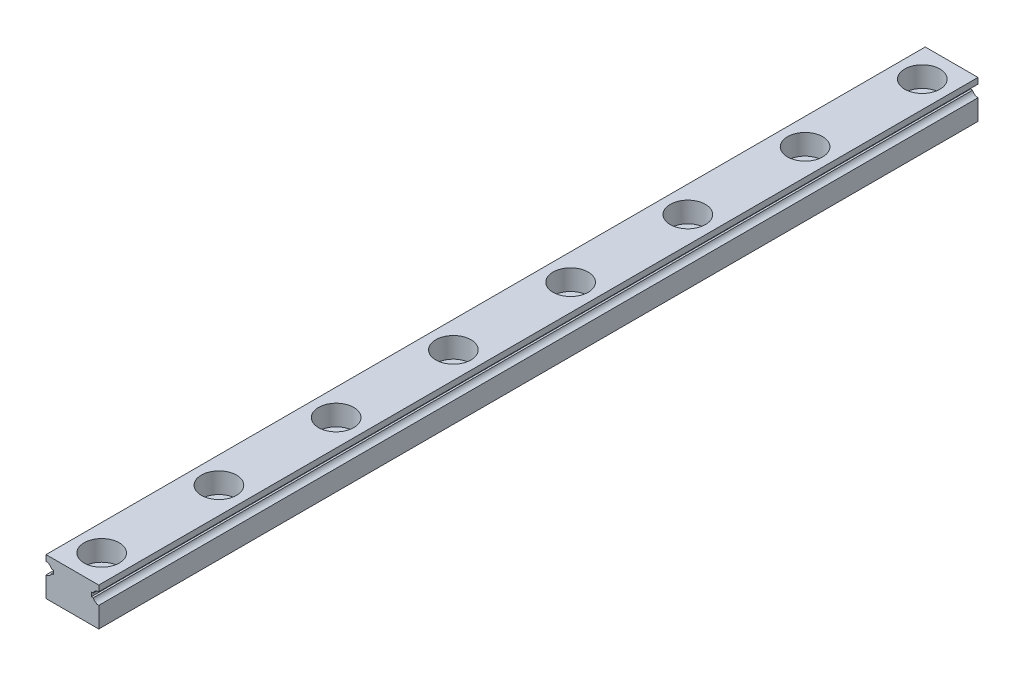
ISO-10303-21;
HEADER;
FILE_DESCRIPTION(('STEP AP214'),'2;1');
FILE_NAME('part.step','',(''),(''),'','','');
FILE_SCHEMA(('AUTOMOTIVE_DESIGN { 1 0 10303 214 1 1 1 1 }'));
ENDSEC;
DATA;
#1=APPLICATION_CONTEXT('core data for automotive mechanical design processes');
#2=APPLICATION_PROTOCOL_DEFINITION('international standard','automotive_design',2000,#1);
#3=PRODUCT_CONTEXT('',#1,'mechanical');
#4=PRODUCT('Part','Part','',(#3));
#5=PRODUCT_RELATED_PRODUCT_CATEGORY('part','',(#4));
#6=PRODUCT_DEFINITION_FORMATION('','',#4);
#7=PRODUCT_DEFINITION_CONTEXT('part definition',#1,'design');
#8=PRODUCT_DEFINITION('design','',#6,#7);
#9=PRODUCT_DEFINITION_SHAPE('','',#8);
#10=(LENGTH_UNIT() NAMED_UNIT(*) SI_UNIT(.MILLI.,.METRE.));
#11=(NAMED_UNIT(*) PLANE_ANGLE_UNIT() SI_UNIT($,.RADIAN.));
#12=(NAMED_UNIT(*) SI_UNIT($,.STERADIAN.) SOLID_ANGLE_UNIT());
#13=UNCERTAINTY_MEASURE_WITH_UNIT(LENGTH_MEASURE(1.E-05),#10,'distance_accuracy_value','');
#14=(GEOMETRIC_REPRESENTATION_CONTEXT(3) GLOBAL_UNCERTAINTY_ASSIGNED_CONTEXT((#13)) GLOBAL_UNIT_ASSIGNED_CONTEXT((#10,
#11,#12)) REPRESENTATION_CONTEXT('',''));
#15=CARTESIAN_POINT('',(0.,0.,0.));
#16=DIRECTION('',(0.,0.,1.));
#17=DIRECTION('',(1.,0.,0.));
#18=AXIS2_PLACEMENT_3D('',#15,#16,#17);
#19=CARTESIAN_POINT('',(4.5,2.25,150.));
#20=DIRECTION('',(-1.,0.,0.));
#21=DIRECTION('',(0.,-1.,0.));
#22=AXIS2_PLACEMENT_3D('',#19,#20,#21);
#23=PLANE('',#22);
#24=DIRECTION('',(0.,1.,0.));
#25=VECTOR('',#24,1.);
#26=CARTESIAN_POINT('',(4.5,2.25,0.));
#27=LINE('',#26,#25);
#28=CARTESIAN_POINT('',(4.5,2.25,0.));
#29=VERTEX_POINT('',#28);
#30=CARTESIAN_POINT('',(4.5,3.25,0.));
#31=VERTEX_POINT('',#30);
#32=EDGE_CURVE('E183',#29,#31,#27,.T.);
#33=ORIENTED_EDGE('',*,*,#32,.T.);
#34=DIRECTION('',(0.,0.,-1.));
#35=VECTOR('',#34,1.);
#36=CARTESIAN_POINT('',(4.5,3.25,150.));
#37=LINE('',#36,#35);
#38=CARTESIAN_POINT('',(4.5,3.25,150.));
#39=VERTEX_POINT('',#38);
#40=EDGE_CURVE('E251',#39,#31,#37,.T.);
#41=ORIENTED_EDGE('',*,*,#40,.F.);
#42=DIRECTION('',(0.,1.,0.));
#43=VECTOR('',#42,1.);
#44=CARTESIAN_POINT('',(4.5,2.25,150.));
#45=LINE('',#44,#43);
#46=CARTESIAN_POINT('',(4.5,2.25,150.));
#47=VERTEX_POINT('',#46);
#48=EDGE_CURVE('E214',#47,#39,#45,.T.);
#49=ORIENTED_EDGE('',*,*,#48,.F.);
#50=DIRECTION('',(0.,0.,-1.));
#51=VECTOR('',#50,1.);
#52=CARTESIAN_POINT('',(4.5,2.25,150.));
#53=LINE('',#52,#51);
#54=EDGE_CURVE('E179',#47,#29,#53,.T.);
#55=ORIENTED_EDGE('',*,*,#54,.T.);
#56=EDGE_LOOP('',(#33,#41,#49,#55));
#57=FACE_BOUND('',#56,.T.);
#58=ADVANCED_FACE('F35',(#57),#23,.F.);
#59=CARTESIAN_POINT('',(-4.5,3.25,150.));
#60=DIRECTION('',(0.,-1.,0.));
#61=DIRECTION('',(0.,0.,-1.));
#62=AXIS2_PLACEMENT_3D('',#59,#60,#61);
#63=PLANE('',#62);
#64=CARTESIAN_POINT('',(0.,3.25,25.));
#65=DIRECTION('',(0.,1.,0.));
#66=DIRECTION('',(0.,0.,1.));
#67=AXIS2_PLACEMENT_3D('',#64,#65,#66);
#68=CIRCLE('',#67,3.);
#69=CARTESIAN_POINT('',(0.,3.25,28.));
#70=VERTEX_POINT('',#69);
#71=EDGE_CURVE('E293',#70,#70,#68,.T.);
#72=ORIENTED_EDGE('',*,*,#71,.F.);
#73=EDGE_LOOP('',(#72));
#74=FACE_BOUND('',#73,.T.);
#75=CARTESIAN_POINT('',(0.,3.25,5.));
#76=DIRECTION('',(0.,1.,0.));
#77=DIRECTION('',(0.,0.,1.));
#78=AXIS2_PLACEMENT_3D('',#75,#76,#77);
#79=CIRCLE('',#78,3.);
#80=CARTESIAN_POINT('',(0.,3.25,8.));
#81=VERTEX_POINT('',#80);
#82=EDGE_CURVE('E257',#81,#81,#79,.T.);
#83=ORIENTED_EDGE('',*,*,#82,.F.);
#84=EDGE_LOOP('',(#83));
#85=FACE_BOUND('',#84,.T.);
#86=DIRECTION('',(-1.,0.,0.));
#87=VECTOR('',#86,1.);
#88=CARTESIAN_POINT('',(-4.5,3.25,0.));
#89=LINE('',#88,#87);
#90=CARTESIAN_POINT('',(-4.5,3.25,0.));
#91=VERTEX_POINT('',#90);
#92=EDGE_CURVE('E186',#31,#91,#89,.T.);
#93=ORIENTED_EDGE('',*,*,#92,.T.);
#94=DIRECTION('',(0.,0.,-1.));
#95=VECTOR('',#94,1.);
#96=CARTESIAN_POINT('',(-4.5,3.25,150.));
#97=LINE('',#96,#95);
#98=CARTESIAN_POINT('',(-4.5,3.25,150.));
#99=VERTEX_POINT('',#98);
#100=EDGE_CURVE('E248',#99,#91,#97,.T.);
#101=ORIENTED_EDGE('',*,*,#100,.F.);
#102=DIRECTION('',(-1.,0.,0.));
#103=VECTOR('',#102,1.);
#104=CARTESIAN_POINT('',(-4.5,3.25,150.));
#105=LINE('',#104,#103);
#106=EDGE_CURVE('E122',#39,#99,#105,.T.);
#107=ORIENTED_EDGE('',*,*,#106,.F.);
#108=ORIENTED_EDGE('',*,*,#40,.T.);
#109=EDGE_LOOP('',(#93,#101,#107,#108));
#110=FACE_BOUND('',#109,.T.);
#111=CARTESIAN_POINT('',(0.,3.25,45.));
#112=DIRECTION('',(0.,1.,0.));
#113=DIRECTION('',(0.,0.,1.));
#114=AXIS2_PLACEMENT_3D('',#111,#112,#113);
#115=CIRCLE('',#114,3.);
#116=CARTESIAN_POINT('',(0.,3.25,48.));
#117=VERTEX_POINT('',#116);
#118=EDGE_CURVE('E253',#117,#117,#115,.T.);
#119=ORIENTED_EDGE('',*,*,#118,.F.);
#120=EDGE_LOOP('',(#119));
#121=FACE_BOUND('',#120,.T.);
#122=CARTESIAN_POINT('',(0.,3.25,65.));
#123=DIRECTION('',(0.,1.,0.));
#124=DIRECTION('',(0.,0.,1.));
#125=AXIS2_PLACEMENT_3D('',#122,#123,#124);
#126=CIRCLE('',#125,3.);
#127=CARTESIAN_POINT('',(0.,3.25,68.));
#128=VERTEX_POINT('',#127);
#129=EDGE_CURVE('E264',#128,#128,#126,.T.);
#130=ORIENTED_EDGE('',*,*,#129,.F.);
#131=EDGE_LOOP('',(#130));
#132=FACE_BOUND('',#131,.T.);
#133=CARTESIAN_POINT('',(0.,3.25,85.));
#134=DIRECTION('',(0.,1.,0.));
#135=DIRECTION('',(0.,0.,1.));
#136=AXIS2_PLACEMENT_3D('',#133,#134,#135);
#137=CIRCLE('',#136,3.);
#138=CARTESIAN_POINT('',(0.,3.25,88.));
#139=VERTEX_POINT('',#138);
#140=EDGE_CURVE('E270',#139,#139,#137,.T.);
#141=ORIENTED_EDGE('',*,*,#140,.F.);
#142=EDGE_LOOP('',(#141));
#143=FACE_BOUND('',#142,.T.);
#144=CARTESIAN_POINT('',(0.,3.25,105.));
#145=DIRECTION('',(0.,1.,0.));
#146=DIRECTION('',(0.,0.,1.));
#147=AXIS2_PLACEMENT_3D('',#144,#145,#146);
#148=CIRCLE('',#147,3.);
#149=CARTESIAN_POINT('',(0.,3.25,108.));
#150=VERTEX_POINT('',#149);
#151=EDGE_CURVE('E276',#150,#150,#148,.T.);
#152=ORIENTED_EDGE('',*,*,#151,.F.);
#153=EDGE_LOOP('',(#152));
#154=FACE_BOUND('',#153,.T.);
#155=CARTESIAN_POINT('',(0.,3.25,125.));
#156=DIRECTION('',(0.,1.,0.));
#157=DIRECTION('',(0.,0.,1.));
#158=AXIS2_PLACEMENT_3D('',#155,#156,#157);
#159=CIRCLE('',#158,3.);
#160=CARTESIAN_POINT('',(0.,3.25,128.));
#161=VERTEX_POINT('',#160);
#162=EDGE_CURVE('E282',#161,#161,#159,.T.);
#163=ORIENTED_EDGE('',*,*,#162,.F.);
#164=EDGE_LOOP('',(#163));
#165=FACE_BOUND('',#164,.T.);
#166=CARTESIAN_POINT('',(0.,3.25,145.));
#167=DIRECTION('',(0.,1.,0.));
#168=DIRECTION('',(0.,0.,1.));
#169=AXIS2_PLACEMENT_3D('',#166,#167,#168);
#170=CIRCLE('',#169,3.);
#171=CARTESIAN_POINT('',(0.,3.25,148.));
#172=VERTEX_POINT('',#171);
#173=EDGE_CURVE('E45',#172,#172,#170,.T.);
#174=ORIENTED_EDGE('',*,*,#173,.F.);
#175=EDGE_LOOP('',(#174));
#176=FACE_BOUND('',#175,.T.);
#177=ADVANCED_FACE('F393',(#74,#85,#110,#121,#132,#143,#154,#165,#176),#63,.F.);
#178=CARTESIAN_POINT('',(-4.5,2.25,150.));
#179=DIRECTION('',(1.,0.,0.));
#180=DIRECTION('',(0.,0.,-1.));
#181=AXIS2_PLACEMENT_3D('',#178,#179,#180);
#182=PLANE('',#181);
#183=DIRECTION('',(0.,-1.,0.));
#184=VECTOR('',#183,1.);
#185=CARTESIAN_POINT('',(-4.5,2.25,0.));
#186=LINE('',#185,#184);
#187=CARTESIAN_POINT('',(-4.5,2.25,0.));
#188=VERTEX_POINT('',#187);
#189=EDGE_CURVE('E189',#91,#188,#186,.T.);
#190=ORIENTED_EDGE('',*,*,#189,.T.);
#191=DIRECTION('',(0.,0.,-1.));
#192=VECTOR('',#191,1.);
#193=CARTESIAN_POINT('',(-4.5,2.25,150.));
#194=LINE('',#193,#192);
#195=CARTESIAN_POINT('',(-4.5,2.25,150.));
#196=VERTEX_POINT('',#195);
#197=EDGE_CURVE('E245',#196,#188,#194,.T.);
#198=ORIENTED_EDGE('',*,*,#197,.F.);
#199=DIRECTION('',(0.,-1.,0.));
#200=VECTOR('',#199,1.);
#201=CARTESIAN_POINT('',(-4.5,2.25,150.));
#202=LINE('',#201,#200);
#203=EDGE_CURVE('E346',#99,#196,#202,.T.);
#204=ORIENTED_EDGE('',*,*,#203,.F.);
#205=ORIENTED_EDGE('',*,*,#100,.T.);
#206=EDGE_LOOP('',(#190,#198,#204,#205));
#207=FACE_BOUND('',#206,.T.);
#208=ADVANCED_FACE('F398',(#207),#182,.F.);
#209=CARTESIAN_POINT('',(-4.5,1.25,150.));
#210=DIRECTION('',(0.,0.,-1.));
#211=DIRECTION('',(-1.,0.,0.));
#212=AXIS2_PLACEMENT_3D('',#209,#210,#211);
#213=CYLINDRICAL_SURFACE('',#212,1.);
#214=CARTESIAN_POINT('',(-4.5,1.25,0.));
#215=DIRECTION('',(0.,0.,-1.));
#216=DIRECTION('',(1.,0.,0.));
#217=AXIS2_PLACEMENT_3D('',#214,#215,#216);
#218=CIRCLE('',#217,1.);
#219=CARTESIAN_POINT('',(-3.56399113733362,1.60197643246385,0.));
#220=VERTEX_POINT('',#219);
#221=EDGE_CURVE('E191',#188,#220,#218,.T.);
#222=ORIENTED_EDGE('',*,*,#221,.T.);
#223=DIRECTION('',(0.,0.,-1.));
#224=VECTOR('',#223,1.);
#225=CARTESIAN_POINT('',(-3.56399113733362,1.60197643246385,150.));
#226=LINE('',#225,#224);
#227=CARTESIAN_POINT('',(-3.56399113733362,1.60197643246385,150.));
#228=VERTEX_POINT('',#227);
#229=EDGE_CURVE('E242',#228,#220,#226,.T.);
#230=ORIENTED_EDGE('',*,*,#229,.F.);
#231=CARTESIAN_POINT('',(-4.5,1.25,150.));
#232=DIRECTION('',(0.,0.,-1.));
#233=DIRECTION('',(1.,0.,0.));
#234=AXIS2_PLACEMENT_3D('',#231,#232,#233);
#235=CIRCLE('',#234,1.);
#236=EDGE_CURVE('E348',#196,#228,#235,.T.);
#237=ORIENTED_EDGE('',*,*,#236,.F.);
#238=ORIENTED_EDGE('',*,*,#197,.T.);
#239=EDGE_LOOP('',(#222,#230,#237,#238));
#240=FACE_BOUND('',#239,.T.);
#241=ADVANCED_FACE('F523',(#240),#213,.F.);
#242=CARTESIAN_POINT('',(-3.56399113733362,1.60197643246385,150.));
#243=DIRECTION('',(0.,1.,0.));
#244=DIRECTION('',(0.,0.,1.));
#245=AXIS2_PLACEMENT_3D('',#242,#243,#244);
#246=PLANE('',#245);
#247=DIRECTION('',(1.,0.,0.));
#248=VECTOR('',#247,1.);
#249=CARTESIAN_POINT('',(-3.56399113733362,1.60197643246385,0.));
#250=LINE('',#249,#248);
#251=CARTESIAN_POINT('',(-3.23507302495561,1.60197643246385,0.));
#252=VERTEX_POINT('',#251);
#253=EDGE_CURVE('E193',#220,#252,#250,.T.);
#254=ORIENTED_EDGE('',*,*,#253,.T.);
#255=DIRECTION('',(0.,0.,-1.));
#256=VECTOR('',#255,1.);
#257=CARTESIAN_POINT('',(-3.23507302495561,1.60197643246385,150.));
#258=LINE('',#257,#256);
#259=CARTESIAN_POINT('',(-3.23507302495561,1.60197643246385,150.));
#260=VERTEX_POINT('',#259);
#261=EDGE_CURVE('E239',#260,#252,#258,.T.);
#262=ORIENTED_EDGE('',*,*,#261,.F.);
#263=DIRECTION('',(1.,0.,0.));
#264=VECTOR('',#263,1.);
#265=CARTESIAN_POINT('',(-3.56399113733362,1.60197643246385,150.));
#266=LINE('',#265,#264);
#267=EDGE_CURVE('E350',#228,#260,#266,.T.);
#268=ORIENTED_EDGE('',*,*,#267,.F.);
#269=ORIENTED_EDGE('',*,*,#229,.T.);
#270=EDGE_LOOP('',(#254,#262,#268,#269));
#271=FACE_BOUND('',#270,.T.);
#272=ADVANCED_FACE('F519',(#271),#246,.F.);
#273=CARTESIAN_POINT('',(-3.23507302495561,0.898023567536146,150.));
#274=DIRECTION('',(1.,0.,0.));
#275=DIRECTION('',(0.,0.,-1.));
#276=AXIS2_PLACEMENT_3D('',#273,#274,#275);
#277=PLANE('',#276);
#278=DIRECTION('',(0.,-1.,0.));
#279=VECTOR('',#278,1.);
#280=CARTESIAN_POINT('',(-3.23507302495561,0.898023567536146,0.));
#281=LINE('',#280,#279);
#282=CARTESIAN_POINT('',(-3.23507302495561,0.898023567536146,0.));
#283=VERTEX_POINT('',#282);
#284=EDGE_CURVE('E195',#252,#283,#281,.T.);
#285=ORIENTED_EDGE('',*,*,#284,.T.);
#286=DIRECTION('',(0.,0.,-1.));
#287=VECTOR('',#286,1.);
#288=CARTESIAN_POINT('',(-3.23507302495561,0.898023567536146,150.));
#289=LINE('',#288,#287);
#290=CARTESIAN_POINT('',(-3.23507302495561,0.898023567536146,150.));
#291=VERTEX_POINT('',#290);
#292=EDGE_CURVE('E236',#291,#283,#289,.T.);
#293=ORIENTED_EDGE('',*,*,#292,.F.);
#294=DIRECTION('',(0.,-1.,0.));
#295=VECTOR('',#294,1.);
#296=CARTESIAN_POINT('',(-3.23507302495561,0.898023567536146,150.));
#297=LINE('',#296,#295);
#298=EDGE_CURVE('E352',#260,#291,#297,.T.);
#299=ORIENTED_EDGE('',*,*,#298,.F.);
#300=ORIENTED_EDGE('',*,*,#261,.T.);
#301=EDGE_LOOP('',(#285,#293,#299,#300));
#302=FACE_BOUND('',#301,.T.);
#303=ADVANCED_FACE('F515',(#302),#277,.F.);
#304=CARTESIAN_POINT('',(-3.56399113733362,0.898023567536146,150.));
#305=DIRECTION('',(0.,-1.,0.));
#306=DIRECTION('',(0.,0.,-1.));
#307=AXIS2_PLACEMENT_3D('',#304,#305,#306);
#308=PLANE('',#307);
#309=DIRECTION('',(-1.,0.,0.));
#310=VECTOR('',#309,1.);
#311=CARTESIAN_POINT('',(-3.56399113733362,0.898023567536146,0.));
#312=LINE('',#311,#310);
#313=CARTESIAN_POINT('',(-3.56399113733362,0.898023567536146,0.));
#314=VERTEX_POINT('',#313);
#315=EDGE_CURVE('E197',#283,#314,#312,.T.);
#316=ORIENTED_EDGE('',*,*,#315,.T.);
#317=DIRECTION('',(0.,0.,-1.));
#318=VECTOR('',#317,1.);
#319=CARTESIAN_POINT('',(-3.56399113733362,0.898023567536146,150.));
#320=LINE('',#319,#318);
#321=CARTESIAN_POINT('',(-3.56399113733362,0.898023567536146,150.));
#322=VERTEX_POINT('',#321);
#323=EDGE_CURVE('E233',#322,#314,#320,.T.);
#324=ORIENTED_EDGE('',*,*,#323,.F.);
#325=DIRECTION('',(-1.,0.,0.));
#326=VECTOR('',#325,1.);
#327=CARTESIAN_POINT('',(-3.56399113733362,0.898023567536146,150.));
#328=LINE('',#327,#326);
#329=EDGE_CURVE('E354',#291,#322,#328,.T.);
#330=ORIENTED_EDGE('',*,*,#329,.F.);
#331=ORIENTED_EDGE('',*,*,#292,.T.);
#332=EDGE_LOOP('',(#316,#324,#330,#331));
#333=FACE_BOUND('',#332,.T.);
#334=ADVANCED_FACE('F511',(#333),#308,.F.);
#335=CARTESIAN_POINT('',(-4.5,1.25,150.));
#336=DIRECTION('',(0.,0.,-1.));
#337=DIRECTION('',(-1.,0.,0.));
#338=AXIS2_PLACEMENT_3D('',#335,#336,#337);
#339=CYLINDRICAL_SURFACE('',#338,1.);
#340=CARTESIAN_POINT('',(-4.5,1.25,0.));
#341=DIRECTION('',(0.,0.,-1.));
#342=DIRECTION('',(1.,0.,0.));
#343=AXIS2_PLACEMENT_3D('',#340,#341,#342);
#344=CIRCLE('',#343,1.);
#345=CARTESIAN_POINT('',(-4.5,0.25,0.));
#346=VERTEX_POINT('',#345);
#347=EDGE_CURVE('E199',#314,#346,#344,.T.);
#348=ORIENTED_EDGE('',*,*,#347,.T.);
#349=DIRECTION('',(0.,0.,-1.));
#350=VECTOR('',#349,1.);
#351=CARTESIAN_POINT('',(-4.5,0.25,150.));
#352=LINE('',#351,#350);
#353=CARTESIAN_POINT('',(-4.5,0.25,150.));
#354=VERTEX_POINT('',#353);
#355=EDGE_CURVE('E230',#354,#346,#352,.T.);
#356=ORIENTED_EDGE('',*,*,#355,.F.);
#357=CARTESIAN_POINT('',(-4.5,1.25,150.));
#358=DIRECTION('',(0.,0.,-1.));
#359=DIRECTION('',(1.,0.,0.));
#360=AXIS2_PLACEMENT_3D('',#357,#358,#359);
#361=CIRCLE('',#360,1.);
#362=EDGE_CURVE('E356',#322,#354,#361,.T.);
#363=ORIENTED_EDGE('',*,*,#362,.F.);
#364=ORIENTED_EDGE('',*,*,#323,.T.);
#365=EDGE_LOOP('',(#348,#356,#363,#364));
#366=FACE_BOUND('',#365,.T.);
#367=ADVANCED_FACE('F507',(#366),#339,.F.);
#368=CARTESIAN_POINT('',(-4.5,-3.25,150.));
#369=DIRECTION('',(1.,0.,0.));
#370=DIRECTION('',(0.,0.,-1.));
#371=AXIS2_PLACEMENT_3D('',#368,#369,#370);
#372=PLANE('',#371);
#373=DIRECTION('',(0.,-1.,0.));
#374=VECTOR('',#373,1.);
#375=CARTESIAN_POINT('',(-4.5,-3.25,0.));
#376=LINE('',#375,#374);
#377=CARTESIAN_POINT('',(-4.5,-3.25,0.));
#378=VERTEX_POINT('',#377);
#379=EDGE_CURVE('E201',#346,#378,#376,.T.);
#380=ORIENTED_EDGE('',*,*,#379,.T.);
#381=DIRECTION('',(0.,0.,-1.));
#382=VECTOR('',#381,1.);
#383=CARTESIAN_POINT('',(-4.5,-3.25,150.));
#384=LINE('',#383,#382);
#385=CARTESIAN_POINT('',(-4.5,-3.25,150.));
#386=VERTEX_POINT('',#385);
#387=EDGE_CURVE('E227',#386,#378,#384,.T.);
#388=ORIENTED_EDGE('',*,*,#387,.F.);
#389=DIRECTION('',(0.,-1.,0.));
#390=VECTOR('',#389,1.);
#391=CARTESIAN_POINT('',(-4.5,-3.25,150.));
#392=LINE('',#391,#390);
#393=EDGE_CURVE('E358',#354,#386,#392,.T.);
#394=ORIENTED_EDGE('',*,*,#393,.F.);
#395=ORIENTED_EDGE('',*,*,#355,.T.);
#396=EDGE_LOOP('',(#380,#388,#394,#395));
#397=FACE_BOUND('',#396,.T.);
#398=ADVANCED_FACE('F475',(#397),#372,.F.);
#399=CARTESIAN_POINT('',(-4.5,-3.25,150.));
#400=DIRECTION('',(0.,1.,0.));
#401=DIRECTION('',(0.,0.,1.));
#402=AXIS2_PLACEMENT_3D('',#399,#400,#401);
#403=PLANE('',#402);
#404=CARTESIAN_POINT('',(0.,-3.25,145.));
#405=DIRECTION('',(0.,1.,0.));
#406=DIRECTION('',(0.,0.,1.));
#407=AXIS2_PLACEMENT_3D('',#404,#405,#406);
#408=CIRCLE('',#407,1.75);
#409=CARTESIAN_POINT('',(0.,-3.25,146.75));
#410=VERTEX_POINT('',#409);
#411=EDGE_CURVE('E322',#410,#410,#408,.T.);
#412=ORIENTED_EDGE('',*,*,#411,.T.);
#413=EDGE_LOOP('',(#412));
#414=FACE_BOUND('',#413,.T.);
#415=CARTESIAN_POINT('',(0.,-3.25,125.));
#416=DIRECTION('',(0.,1.,0.));
#417=DIRECTION('',(0.,0.,1.));
#418=AXIS2_PLACEMENT_3D('',#415,#416,#417);
#419=CIRCLE('',#418,1.75);
#420=CARTESIAN_POINT('',(0.,-3.25,126.75));
#421=VERTEX_POINT('',#420);
#422=EDGE_CURVE('E312',#421,#421,#419,.T.);
#423=ORIENTED_EDGE('',*,*,#422,.T.);
#424=EDGE_LOOP('',(#423));
#425=FACE_BOUND('',#424,.T.);
#426=CARTESIAN_POINT('',(0.,-3.25,105.));
#427=DIRECTION('',(0.,1.,0.));
#428=DIRECTION('',(0.,0.,1.));
#429=AXIS2_PLACEMENT_3D('',#426,#427,#428);
#430=CIRCLE('',#429,1.75);
#431=CARTESIAN_POINT('',(0.,-3.25,106.75));
#432=VERTEX_POINT('',#431);
#433=EDGE_CURVE('E309',#432,#432,#430,.T.);
#434=ORIENTED_EDGE('',*,*,#433,.T.);
#435=EDGE_LOOP('',(#434));
#436=FACE_BOUND('',#435,.T.);
#437=CARTESIAN_POINT('',(0.,-3.25,85.));
#438=DIRECTION('',(0.,1.,0.));
#439=DIRECTION('',(0.,0.,1.));
#440=AXIS2_PLACEMENT_3D('',#437,#438,#439);
#441=CIRCLE('',#440,1.75);
#442=CARTESIAN_POINT('',(0.,-3.25,86.75));
#443=VERTEX_POINT('',#442);
#444=EDGE_CURVE('E306',#443,#443,#441,.T.);
#445=ORIENTED_EDGE('',*,*,#444,.T.);
#446=EDGE_LOOP('',(#445));
#447=FACE_BOUND('',#446,.T.);
#448=CARTESIAN_POINT('',(0.,-3.25,65.));
#449=DIRECTION('',(0.,1.,0.));
#450=DIRECTION('',(0.,0.,1.));
#451=AXIS2_PLACEMENT_3D('',#448,#449,#450);
#452=CIRCLE('',#451,1.75);
#453=CARTESIAN_POINT('',(0.,-3.25,66.75));
#454=VERTEX_POINT('',#453);
#455=EDGE_CURVE('E302',#454,#454,#452,.T.);
#456=ORIENTED_EDGE('',*,*,#455,.T.);
#457=EDGE_LOOP('',(#456));
#458=FACE_BOUND('',#457,.T.);
#459=CARTESIAN_POINT('',(0.,-3.25,45.));
#460=DIRECTION('',(0.,1.,0.));
#461=DIRECTION('',(0.,0.,1.));
#462=AXIS2_PLACEMENT_3D('',#459,#460,#461);
#463=CIRCLE('',#462,1.75);
#464=CARTESIAN_POINT('',(0.,-3.25,46.75));
#465=VERTEX_POINT('',#464);
#466=EDGE_CURVE('E298',#465,#465,#463,.T.);
#467=ORIENTED_EDGE('',*,*,#466,.T.);
#468=EDGE_LOOP('',(#467));
#469=FACE_BOUND('',#468,.T.);
#470=CARTESIAN_POINT('',(0.,-3.25,25.));
#471=DIRECTION('',(0.,1.,0.));
#472=DIRECTION('',(0.,0.,1.));
#473=AXIS2_PLACEMENT_3D('',#470,#471,#472);
#474=CIRCLE('',#473,1.75);
#475=CARTESIAN_POINT('',(0.,-3.25,26.75));
#476=VERTEX_POINT('',#475);
#477=EDGE_CURVE('E294',#476,#476,#474,.T.);
#478=ORIENTED_EDGE('',*,*,#477,.T.);
#479=EDGE_LOOP('',(#478));
#480=FACE_BOUND('',#479,.T.);
#481=CARTESIAN_POINT('',(0.,-3.25,5.));
#482=DIRECTION('',(0.,1.,0.));
#483=DIRECTION('',(0.,0.,1.));
#484=AXIS2_PLACEMENT_3D('',#481,#482,#483);
#485=CIRCLE('',#484,1.75);
#486=CARTESIAN_POINT('',(0.,-3.25,6.75));
#487=VERTEX_POINT('',#486);
#488=EDGE_CURVE('E258',#487,#487,#485,.T.);
#489=ORIENTED_EDGE('',*,*,#488,.T.);
#490=EDGE_LOOP('',(#489));
#491=FACE_BOUND('',#490,.T.);
#492=DIRECTION('',(1.,0.,0.));
#493=VECTOR('',#492,1.);
#494=CARTESIAN_POINT('',(-4.5,-3.25,0.));
#495=LINE('',#494,#493);
#496=CARTESIAN_POINT('',(4.5,-3.25,0.));
#497=VERTEX_POINT('',#496);
#498=EDGE_CURVE('E203',#378,#497,#495,.T.);
#499=ORIENTED_EDGE('',*,*,#498,.T.);
#500=DIRECTION('',(0.,0.,-1.));
#501=VECTOR('',#500,1.);
#502=CARTESIAN_POINT('',(4.5,-3.25,150.));
#503=LINE('',#502,#501);
#504=CARTESIAN_POINT('',(4.5,-3.25,150.));
#505=VERTEX_POINT('',#504);
#506=EDGE_CURVE('E224',#505,#497,#503,.T.);
#507=ORIENTED_EDGE('',*,*,#506,.F.);
#508=DIRECTION('',(1.,0.,0.));
#509=VECTOR('',#508,1.);
#510=CARTESIAN_POINT('',(-4.5,-3.25,150.));
#511=LINE('',#510,#509);
#512=EDGE_CURVE('E360',#386,#505,#511,.T.);
#513=ORIENTED_EDGE('',*,*,#512,.F.);
#514=ORIENTED_EDGE('',*,*,#387,.T.);
#515=EDGE_LOOP('',(#499,#507,#513,#514));
#516=FACE_BOUND('',#515,.T.);
#517=ADVANCED_FACE('F472',(#414,#425,#436,#447,#458,#469,#480,#491,#516),#403,.F.);
#518=CARTESIAN_POINT('',(4.5,-3.25,150.));
#519=DIRECTION('',(-1.,0.,0.));
#520=DIRECTION('',(0.,-1.,0.));
#521=AXIS2_PLACEMENT_3D('',#518,#519,#520);
#522=PLANE('',#521);
#523=DIRECTION('',(0.,1.,0.));
#524=VECTOR('',#523,1.);
#525=CARTESIAN_POINT('',(4.5,-3.25,0.));
#526=LINE('',#525,#524);
#527=CARTESIAN_POINT('',(4.5,0.25,0.));
#528=VERTEX_POINT('',#527);
#529=EDGE_CURVE('E205',#497,#528,#526,.T.);
#530=ORIENTED_EDGE('',*,*,#529,.T.);
#531=DIRECTION('',(0.,0.,-1.));
#532=VECTOR('',#531,1.);
#533=CARTESIAN_POINT('',(4.5,0.25,150.));
#534=LINE('',#533,#532);
#535=CARTESIAN_POINT('',(4.5,0.25,150.));
#536=VERTEX_POINT('',#535);
#537=EDGE_CURVE('E221',#536,#528,#534,.T.);
#538=ORIENTED_EDGE('',*,*,#537,.F.);
#539=DIRECTION('',(0.,1.,0.));
#540=VECTOR('',#539,1.);
#541=CARTESIAN_POINT('',(4.5,-3.25,150.));
#542=LINE('',#541,#540);
#543=EDGE_CURVE('E362',#505,#536,#542,.T.);
#544=ORIENTED_EDGE('',*,*,#543,.F.);
#545=ORIENTED_EDGE('',*,*,#506,.T.);
#546=EDGE_LOOP('',(#530,#538,#544,#545));
#547=FACE_BOUND('',#546,.T.);
#548=ADVANCED_FACE('F474',(#547),#522,.F.);
#549=CARTESIAN_POINT('',(4.5,1.25,150.));
#550=DIRECTION('',(0.,0.,-1.));
#551=DIRECTION('',(-1.,0.,0.));
#552=AXIS2_PLACEMENT_3D('',#549,#550,#551);
#553=CYLINDRICAL_SURFACE('',#552,1.);
#554=CARTESIAN_POINT('',(4.5,1.25,0.));
#555=DIRECTION('',(0.,0.,-1.));
#556=DIRECTION('',(-1.,0.,0.));
#557=AXIS2_PLACEMENT_3D('',#554,#555,#556);
#558=CIRCLE('',#557,1.);
#559=CARTESIAN_POINT('',(3.56399113733362,0.898023567536145,0.));
#560=VERTEX_POINT('',#559);
#561=EDGE_CURVE('E207',#528,#560,#558,.T.);
#562=ORIENTED_EDGE('',*,*,#561,.T.);
#563=DIRECTION('',(0.,0.,-1.));
#564=VECTOR('',#563,1.);
#565=CARTESIAN_POINT('',(3.56399113733362,0.898023567536145,150.));
#566=LINE('',#565,#564);
#567=CARTESIAN_POINT('',(3.56399113733362,0.898023567536145,150.));
#568=VERTEX_POINT('',#567);
#569=EDGE_CURVE('E218',#568,#560,#566,.T.);
#570=ORIENTED_EDGE('',*,*,#569,.F.);
#571=CARTESIAN_POINT('',(4.5,1.25,150.));
#572=DIRECTION('',(0.,0.,-1.));
#573=DIRECTION('',(-1.,0.,0.));
#574=AXIS2_PLACEMENT_3D('',#571,#572,#573);
#575=CIRCLE('',#574,1.);
#576=EDGE_CURVE('E364',#536,#568,#575,.T.);
#577=ORIENTED_EDGE('',*,*,#576,.F.);
#578=ORIENTED_EDGE('',*,*,#537,.T.);
#579=EDGE_LOOP('',(#562,#570,#577,#578));
#580=FACE_BOUND('',#579,.T.);
#581=ADVANCED_FACE('F370',(#580),#553,.F.);
#582=CARTESIAN_POINT('',(3.56399113733362,0.898023567536146,150.));
#583=DIRECTION('',(0.,-1.,0.));
#584=DIRECTION('',(0.,0.,-1.));
#585=AXIS2_PLACEMENT_3D('',#582,#583,#584);
#586=PLANE('',#585);
#587=DIRECTION('',(-1.,0.,0.));
#588=VECTOR('',#587,1.);
#589=CARTESIAN_POINT('',(3.56399113733362,0.898023567536146,0.));
#590=LINE('',#589,#588);
#591=CARTESIAN_POINT('',(3.23507302495561,0.898023567536146,0.));
#592=VERTEX_POINT('',#591);
#593=EDGE_CURVE('E209',#560,#592,#590,.T.);
#594=ORIENTED_EDGE('',*,*,#593,.T.);
#595=DIRECTION('',(0.,0.,-1.));
#596=VECTOR('',#595,1.);
#597=CARTESIAN_POINT('',(3.23507302495561,0.898023567536146,150.));
#598=LINE('',#597,#596);
#599=CARTESIAN_POINT('',(3.23507302495561,0.898023567536146,150.));
#600=VERTEX_POINT('',#599);
#601=EDGE_CURVE('E174',#600,#592,#598,.T.);
#602=ORIENTED_EDGE('',*,*,#601,.F.);
#603=DIRECTION('',(-1.,0.,0.));
#604=VECTOR('',#603,1.);
#605=CARTESIAN_POINT('',(3.56399113733362,0.898023567536146,150.));
#606=LINE('',#605,#604);
#607=EDGE_CURVE('E165',#568,#600,#606,.T.);
#608=ORIENTED_EDGE('',*,*,#607,.F.);
#609=ORIENTED_EDGE('',*,*,#569,.T.);
#610=EDGE_LOOP('',(#594,#602,#608,#609));
#611=FACE_BOUND('',#610,.T.);
#612=ADVANCED_FACE('F374',(#611),#586,.F.);
#613=CARTESIAN_POINT('',(3.23507302495561,0.898023567536146,150.));
#614=DIRECTION('',(-1.,0.,0.));
#615=DIRECTION('',(0.,0.,1.));
#616=AXIS2_PLACEMENT_3D('',#613,#614,#615);
#617=PLANE('',#616);
#618=DIRECTION('',(0.,1.,0.));
#619=VECTOR('',#618,1.);
#620=CARTESIAN_POINT('',(3.23507302495561,0.898023567536146,0.));
#621=LINE('',#620,#619);
#622=CARTESIAN_POINT('',(3.23507302495561,1.60197643246385,0.));
#623=VERTEX_POINT('',#622);
#624=EDGE_CURVE('E173',#592,#623,#621,.T.);
#625=ORIENTED_EDGE('',*,*,#624,.T.);
#626=DIRECTION('',(0.,0.,-1.));
#627=VECTOR('',#626,1.);
#628=CARTESIAN_POINT('',(3.23507302495561,1.60197643246385,150.));
#629=LINE('',#628,#627);
#630=CARTESIAN_POINT('',(3.23507302495561,1.60197643246385,150.));
#631=VERTEX_POINT('',#630);
#632=EDGE_CURVE('E170',#631,#623,#629,.T.);
#633=ORIENTED_EDGE('',*,*,#632,.F.);
#634=DIRECTION('',(0.,1.,0.));
#635=VECTOR('',#634,1.);
#636=CARTESIAN_POINT('',(3.23507302495561,0.898023567536146,150.));
#637=LINE('',#636,#635);
#638=EDGE_CURVE('E159',#600,#631,#637,.T.);
#639=ORIENTED_EDGE('',*,*,#638,.F.);
#640=ORIENTED_EDGE('',*,*,#601,.T.);
#641=EDGE_LOOP('',(#625,#633,#639,#640));
#642=FACE_BOUND('',#641,.T.);
#643=ADVANCED_FACE('F171',(#642),#617,.F.);
#644=CARTESIAN_POINT('',(3.56399113733362,1.60197643246385,150.));
#645=DIRECTION('',(0.,1.,0.));
#646=DIRECTION('',(0.,0.,1.));
#647=AXIS2_PLACEMENT_3D('',#644,#645,#646);
#648=PLANE('',#647);
#649=DIRECTION('',(1.,0.,0.));
#650=VECTOR('',#649,1.);
#651=CARTESIAN_POINT('',(3.56399113733362,1.60197643246385,0.));
#652=LINE('',#651,#650);
#653=CARTESIAN_POINT('',(3.56399113733362,1.60197643246385,0.));
#654=VERTEX_POINT('',#653);
#655=EDGE_CURVE('E107',#623,#654,#652,.T.);
#656=ORIENTED_EDGE('',*,*,#655,.T.);
#657=DIRECTION('',(0.,0.,-1.));
#658=VECTOR('',#657,1.);
#659=CARTESIAN_POINT('',(3.56399113733362,1.60197643246385,150.));
#660=LINE('',#659,#658);
#661=CARTESIAN_POINT('',(3.56399113733362,1.60197643246385,150.));
#662=VERTEX_POINT('',#661);
#663=EDGE_CURVE('E175',#662,#654,#660,.T.);
#664=ORIENTED_EDGE('',*,*,#663,.F.);
#665=DIRECTION('',(1.,0.,0.));
#666=VECTOR('',#665,1.);
#667=CARTESIAN_POINT('',(3.56399113733362,1.60197643246385,150.));
#668=LINE('',#667,#666);
#669=EDGE_CURVE('E163',#631,#662,#668,.T.);
#670=ORIENTED_EDGE('',*,*,#669,.F.);
#671=ORIENTED_EDGE('',*,*,#632,.T.);
#672=EDGE_LOOP('',(#656,#664,#670,#671));
#673=FACE_BOUND('',#672,.T.);
#674=ADVANCED_FACE('F177',(#673),#648,.F.);
#675=CARTESIAN_POINT('',(4.5,1.25,150.));
#676=DIRECTION('',(0.,0.,-1.));
#677=DIRECTION('',(-1.,0.,0.));
#678=AXIS2_PLACEMENT_3D('',#675,#676,#677);
#679=CYLINDRICAL_SURFACE('',#678,1.);
#680=CARTESIAN_POINT('',(4.5,1.25,0.));
#681=DIRECTION('',(0.,0.,-1.));
#682=DIRECTION('',(-1.,0.,0.));
#683=AXIS2_PLACEMENT_3D('',#680,#681,#682);
#684=CIRCLE('',#683,1.);
#685=EDGE_CURVE('E113',#654,#29,#684,.T.);
#686=ORIENTED_EDGE('',*,*,#685,.T.);
#687=ORIENTED_EDGE('',*,*,#54,.F.);
#688=CARTESIAN_POINT('',(4.5,1.25,150.));
#689=DIRECTION('',(0.,0.,-1.));
#690=DIRECTION('',(-1.,0.,0.));
#691=AXIS2_PLACEMENT_3D('',#688,#689,#690);
#692=CIRCLE('',#691,1.);
#693=EDGE_CURVE('E54',#662,#47,#692,.T.);
#694=ORIENTED_EDGE('',*,*,#693,.F.);
#695=ORIENTED_EDGE('',*,*,#663,.T.);
#696=EDGE_LOOP('',(#686,#687,#694,#695));
#697=FACE_BOUND('',#696,.T.);
#698=ADVANCED_FACE('F382',(#697),#679,.F.);
#699=CARTESIAN_POINT('',(-4.5,1.25,150.));
#700=DIRECTION('',(0.,0.,1.));
#701=DIRECTION('',(1.,0.,0.));
#702=AXIS2_PLACEMENT_3D('',#699,#700,#701);
#703=PLANE('',#702);
#704=ORIENTED_EDGE('',*,*,#48,.T.);
#705=ORIENTED_EDGE('',*,*,#106,.T.);
#706=ORIENTED_EDGE('',*,*,#203,.T.);
#707=ORIENTED_EDGE('',*,*,#236,.T.);
#708=ORIENTED_EDGE('',*,*,#267,.T.);
#709=ORIENTED_EDGE('',*,*,#298,.T.);
#710=ORIENTED_EDGE('',*,*,#329,.T.);
#711=ORIENTED_EDGE('',*,*,#362,.T.);
#712=ORIENTED_EDGE('',*,*,#393,.T.);
#713=ORIENTED_EDGE('',*,*,#512,.T.);
#714=ORIENTED_EDGE('',*,*,#543,.T.);
#715=ORIENTED_EDGE('',*,*,#576,.T.);
#716=ORIENTED_EDGE('',*,*,#607,.T.);
#717=ORIENTED_EDGE('',*,*,#638,.T.);
#718=ORIENTED_EDGE('',*,*,#669,.T.);
#719=ORIENTED_EDGE('',*,*,#693,.T.);
#720=EDGE_LOOP('',(#704,#705,#706,#707,#708,#709,#710,#711,#712,#713,#714,#715,#716,#717,#718,#719));
#721=FACE_BOUND('',#720,.T.);
#722=ADVANCED_FACE('F161',(#721),#703,.T.);
#723=CARTESIAN_POINT('',(-4.5,1.25,0.));
#724=DIRECTION('',(0.,0.,1.));
#725=DIRECTION('',(1.,0.,0.));
#726=AXIS2_PLACEMENT_3D('',#723,#724,#725);
#727=PLANE('',#726);
#728=ORIENTED_EDGE('',*,*,#32,.F.);
#729=ORIENTED_EDGE('',*,*,#685,.F.);
#730=ORIENTED_EDGE('',*,*,#655,.F.);
#731=ORIENTED_EDGE('',*,*,#624,.F.);
#732=ORIENTED_EDGE('',*,*,#593,.F.);
#733=ORIENTED_EDGE('',*,*,#561,.F.);
#734=ORIENTED_EDGE('',*,*,#529,.F.);
#735=ORIENTED_EDGE('',*,*,#498,.F.);
#736=ORIENTED_EDGE('',*,*,#379,.F.);
#737=ORIENTED_EDGE('',*,*,#347,.F.);
#738=ORIENTED_EDGE('',*,*,#315,.F.);
#739=ORIENTED_EDGE('',*,*,#284,.F.);
#740=ORIENTED_EDGE('',*,*,#253,.F.);
#741=ORIENTED_EDGE('',*,*,#221,.F.);
#742=ORIENTED_EDGE('',*,*,#189,.F.);
#743=ORIENTED_EDGE('',*,*,#92,.F.);
#744=EDGE_LOOP('',(#728,#729,#730,#731,#732,#733,#734,#735,#736,#737,#738,#739,#740,#741,#742,#743));
#745=FACE_BOUND('',#744,.T.);
#746=ADVANCED_FACE('F377',(#745),#727,.F.);
#747=CARTESIAN_POINT('',(0.,-0.25,5.));
#748=DIRECTION('',(0.,1.,0.));
#749=DIRECTION('',(0.,0.,1.));
#750=AXIS2_PLACEMENT_3D('',#747,#748,#749);
#751=CYLINDRICAL_SURFACE('',#750,3.);
#752=CARTESIAN_POINT('',(0.,-0.25,5.));
#753=DIRECTION('',(0.,1.,0.));
#754=DIRECTION('',(0.,0.,1.));
#755=AXIS2_PLACEMENT_3D('',#752,#753,#754);
#756=CIRCLE('',#755,3.);
#757=CARTESIAN_POINT('',(0.,-0.25,8.));
#758=VERTEX_POINT('',#757);
#759=EDGE_CURVE('E187',#758,#758,#756,.T.);
#760=ORIENTED_EDGE('',*,*,#759,.F.);
#761=EDGE_LOOP('',(#760));
#762=FACE_BOUND('',#761,.T.);
#763=ORIENTED_EDGE('',*,*,#82,.T.);
#764=EDGE_LOOP('',(#763));
#765=FACE_BOUND('',#764,.T.);
#766=ADVANCED_FACE('F758',(#762,#765),#751,.F.);
#767=CARTESIAN_POINT('',(0.,-0.25,5.));
#768=DIRECTION('',(0.,1.,0.));
#769=DIRECTION('',(0.,0.,1.));
#770=AXIS2_PLACEMENT_3D('',#767,#768,#769);
#771=PLANE('',#770);
#772=CARTESIAN_POINT('',(0.,-0.25,5.));
#773=DIRECTION('',(0.,1.,0.));
#774=DIRECTION('',(0.,0.,1.));
#775=AXIS2_PLACEMENT_3D('',#772,#773,#774);
#776=CIRCLE('',#775,1.75);
#777=CARTESIAN_POINT('',(0.,-0.25,6.75));
#778=VERTEX_POINT('',#777);
#779=EDGE_CURVE('E254',#778,#778,#776,.T.);
#780=ORIENTED_EDGE('',*,*,#779,.F.);
#781=EDGE_LOOP('',(#780));
#782=FACE_BOUND('',#781,.T.);
#783=ORIENTED_EDGE('',*,*,#759,.T.);
#784=EDGE_LOOP('',(#783));
#785=FACE_BOUND('',#784,.T.);
#786=ADVANCED_FACE('F754',(#782,#785),#771,.T.);
#787=CARTESIAN_POINT('',(0.,-3.25,5.));
#788=DIRECTION('',(0.,1.,0.));
#789=DIRECTION('',(0.,0.,1.));
#790=AXIS2_PLACEMENT_3D('',#787,#788,#789);
#791=CYLINDRICAL_SURFACE('',#790,1.75);
#792=ORIENTED_EDGE('',*,*,#779,.T.);
#793=EDGE_LOOP('',(#792));
#794=FACE_BOUND('',#793,.T.);
#795=ORIENTED_EDGE('',*,*,#488,.F.);
#796=EDGE_LOOP('',(#795));
#797=FACE_BOUND('',#796,.T.);
#798=ADVANCED_FACE('F608',(#794,#797),#791,.F.);
#799=CARTESIAN_POINT('',(0.,-0.25,25.));
#800=DIRECTION('',(0.,1.,0.));
#801=DIRECTION('',(0.,0.,1.));
#802=AXIS2_PLACEMENT_3D('',#799,#800,#801);
#803=CYLINDRICAL_SURFACE('',#802,3.);
#804=CARTESIAN_POINT('',(0.,-0.25,25.));
#805=DIRECTION('',(0.,1.,0.));
#806=DIRECTION('',(0.,0.,1.));
#807=AXIS2_PLACEMENT_3D('',#804,#805,#806);
#808=CIRCLE('',#807,3.);
#809=CARTESIAN_POINT('',(0.,-0.25,28.));
#810=VERTEX_POINT('',#809);
#811=EDGE_CURVE('E335',#810,#810,#808,.T.);
#812=ORIENTED_EDGE('',*,*,#811,.F.);
#813=EDGE_LOOP('',(#812));
#814=FACE_BOUND('',#813,.T.);
#815=ORIENTED_EDGE('',*,*,#71,.T.);
#816=EDGE_LOOP('',(#815));
#817=FACE_BOUND('',#816,.T.);
#818=ADVANCED_FACE('F603',(#814,#817),#803,.F.);
#819=CARTESIAN_POINT('',(0.,-0.25,25.));
#820=DIRECTION('',(0.,1.,0.));
#821=DIRECTION('',(0.,0.,1.));
#822=AXIS2_PLACEMENT_3D('',#819,#820,#821);
#823=PLANE('',#822);
#824=CARTESIAN_POINT('',(0.,-0.25,25.));
#825=DIRECTION('',(0.,1.,0.));
#826=DIRECTION('',(0.,0.,1.));
#827=AXIS2_PLACEMENT_3D('',#824,#825,#826);
#828=CIRCLE('',#827,1.75);
#829=CARTESIAN_POINT('',(0.,-0.25,26.75));
#830=VERTEX_POINT('',#829);
#831=EDGE_CURVE('E290',#830,#830,#828,.T.);
#832=ORIENTED_EDGE('',*,*,#831,.F.);
#833=EDGE_LOOP('',(#832));
#834=FACE_BOUND('',#833,.T.);
#835=ORIENTED_EDGE('',*,*,#811,.T.);
#836=EDGE_LOOP('',(#835));
#837=FACE_BOUND('',#836,.T.);
#838=ADVANCED_FACE('F411',(#834,#837),#823,.T.);
#839=CARTESIAN_POINT('',(0.,-0.25,45.));
#840=DIRECTION('',(0.,1.,0.));
#841=DIRECTION('',(0.,0.,1.));
#842=AXIS2_PLACEMENT_3D('',#839,#840,#841);
#843=PLANE('',#842);
#844=CARTESIAN_POINT('',(0.,-0.25,45.));
#845=DIRECTION('',(0.,1.,0.));
#846=DIRECTION('',(0.,0.,1.));
#847=AXIS2_PLACEMENT_3D('',#844,#845,#846);
#848=CIRCLE('',#847,1.75);
#849=CARTESIAN_POINT('',(0.,-0.25,46.75));
#850=VERTEX_POINT('',#849);
#851=EDGE_CURVE('E295',#850,#850,#848,.T.);
#852=ORIENTED_EDGE('',*,*,#851,.F.);
#853=EDGE_LOOP('',(#852));
#854=FACE_BOUND('',#853,.T.);
#855=CARTESIAN_POINT('',(0.,-0.25,45.));
#856=DIRECTION('',(0.,1.,0.));
#857=DIRECTION('',(0.,0.,1.));
#858=AXIS2_PLACEMENT_3D('',#855,#856,#857);
#859=CIRCLE('',#858,3.);
#860=CARTESIAN_POINT('',(0.,-0.25,48.));
#861=VERTEX_POINT('',#860);
#862=EDGE_CURVE('E261',#861,#861,#859,.T.);
#863=ORIENTED_EDGE('',*,*,#862,.T.);
#864=EDGE_LOOP('',(#863));
#865=FACE_BOUND('',#864,.T.);
#866=ADVANCED_FACE('F407',(#854,#865),#843,.T.);
#867=CARTESIAN_POINT('',(0.,-0.25,45.));
#868=DIRECTION('',(0.,1.,0.));
#869=DIRECTION('',(0.,0.,1.));
#870=AXIS2_PLACEMENT_3D('',#867,#868,#869);
#871=CYLINDRICAL_SURFACE('',#870,3.);
#872=ORIENTED_EDGE('',*,*,#862,.F.);
#873=EDGE_LOOP('',(#872));
#874=FACE_BOUND('',#873,.T.);
#875=ORIENTED_EDGE('',*,*,#118,.T.);
#876=EDGE_LOOP('',(#875));
#877=FACE_BOUND('',#876,.T.);
#878=ADVANCED_FACE('F403',(#874,#877),#871,.F.);
#879=CARTESIAN_POINT('',(0.,-0.25,65.));
#880=DIRECTION('',(0.,1.,0.));
#881=DIRECTION('',(0.,0.,1.));
#882=AXIS2_PLACEMENT_3D('',#879,#880,#881);
#883=PLANE('',#882);
#884=CARTESIAN_POINT('',(0.,-0.25,65.));
#885=DIRECTION('',(0.,1.,0.));
#886=DIRECTION('',(0.,0.,1.));
#887=AXIS2_PLACEMENT_3D('',#884,#885,#886);
#888=CIRCLE('',#887,1.75);
#889=CARTESIAN_POINT('',(0.,-0.25,66.75));
#890=VERTEX_POINT('',#889);
#891=EDGE_CURVE('E299',#890,#890,#888,.T.);
#892=ORIENTED_EDGE('',*,*,#891,.F.);
#893=EDGE_LOOP('',(#892));
#894=FACE_BOUND('',#893,.T.);
#895=CARTESIAN_POINT('',(0.,-0.25,65.));
#896=DIRECTION('',(0.,1.,0.));
#897=DIRECTION('',(0.,0.,1.));
#898=AXIS2_PLACEMENT_3D('',#895,#896,#897);
#899=CIRCLE('',#898,3.);
#900=CARTESIAN_POINT('',(0.,-0.25,68.));
#901=VERTEX_POINT('',#900);
#902=EDGE_CURVE('E267',#901,#901,#899,.T.);
#903=ORIENTED_EDGE('',*,*,#902,.T.);
#904=EDGE_LOOP('',(#903));
#905=FACE_BOUND('',#904,.T.);
#906=ADVANCED_FACE('F406',(#894,#905),#883,.T.);
#907=CARTESIAN_POINT('',(0.,-0.25,65.));
#908=DIRECTION('',(0.,1.,0.));
#909=DIRECTION('',(0.,0.,1.));
#910=AXIS2_PLACEMENT_3D('',#907,#908,#909);
#911=CYLINDRICAL_SURFACE('',#910,3.);
#912=ORIENTED_EDGE('',*,*,#902,.F.);
#913=EDGE_LOOP('',(#912));
#914=FACE_BOUND('',#913,.T.);
#915=ORIENTED_EDGE('',*,*,#129,.T.);
#916=EDGE_LOOP('',(#915));
#917=FACE_BOUND('',#916,.T.);
#918=ADVANCED_FACE('F413',(#914,#917),#911,.F.);
#919=CARTESIAN_POINT('',(0.,-0.25,85.));
#920=DIRECTION('',(0.,1.,0.));
#921=DIRECTION('',(0.,0.,1.));
#922=AXIS2_PLACEMENT_3D('',#919,#920,#921);
#923=PLANE('',#922);
#924=CARTESIAN_POINT('',(0.,-0.25,85.));
#925=DIRECTION('',(0.,1.,0.));
#926=DIRECTION('',(0.,0.,1.));
#927=AXIS2_PLACEMENT_3D('',#924,#925,#926);
#928=CIRCLE('',#927,1.75);
#929=CARTESIAN_POINT('',(0.,-0.25,86.75));
#930=VERTEX_POINT('',#929);
#931=EDGE_CURVE('E303',#930,#930,#928,.T.);
#932=ORIENTED_EDGE('',*,*,#931,.F.);
#933=EDGE_LOOP('',(#932));
#934=FACE_BOUND('',#933,.T.);
#935=CARTESIAN_POINT('',(0.,-0.25,85.));
#936=DIRECTION('',(0.,1.,0.));
#937=DIRECTION('',(0.,0.,1.));
#938=AXIS2_PLACEMENT_3D('',#935,#936,#937);
#939=CIRCLE('',#938,3.);
#940=CARTESIAN_POINT('',(0.,-0.25,88.));
#941=VERTEX_POINT('',#940);
#942=EDGE_CURVE('E273',#941,#941,#939,.T.);
#943=ORIENTED_EDGE('',*,*,#942,.T.);
#944=EDGE_LOOP('',(#943));
#945=FACE_BOUND('',#944,.T.);
#946=ADVANCED_FACE('F416',(#934,#945),#923,.T.);
#947=CARTESIAN_POINT('',(0.,-0.25,85.));
#948=DIRECTION('',(0.,1.,0.));
#949=DIRECTION('',(0.,0.,1.));
#950=AXIS2_PLACEMENT_3D('',#947,#948,#949);
#951=CYLINDRICAL_SURFACE('',#950,3.);
#952=ORIENTED_EDGE('',*,*,#942,.F.);
#953=EDGE_LOOP('',(#952));
#954=FACE_BOUND('',#953,.T.);
#955=ORIENTED_EDGE('',*,*,#140,.T.);
#956=EDGE_LOOP('',(#955));
#957=FACE_BOUND('',#956,.T.);
#958=ADVANCED_FACE('F421',(#954,#957),#951,.F.);
#959=CARTESIAN_POINT('',(0.,-0.25,105.));
#960=DIRECTION('',(0.,1.,0.));
#961=DIRECTION('',(0.,0.,1.));
#962=AXIS2_PLACEMENT_3D('',#959,#960,#961);
#963=PLANE('',#962);
#964=CARTESIAN_POINT('',(0.,-0.25,105.));
#965=DIRECTION('',(0.,1.,0.));
#966=DIRECTION('',(0.,0.,1.));
#967=AXIS2_PLACEMENT_3D('',#964,#965,#966);
#968=CIRCLE('',#967,1.75);
#969=CARTESIAN_POINT('',(0.,-0.25,106.75));
#970=VERTEX_POINT('',#969);
#971=EDGE_CURVE('E307',#970,#970,#968,.T.);
#972=ORIENTED_EDGE('',*,*,#971,.F.);
#973=EDGE_LOOP('',(#972));
#974=FACE_BOUND('',#973,.T.);
#975=CARTESIAN_POINT('',(0.,-0.25,105.));
#976=DIRECTION('',(0.,1.,0.));
#977=DIRECTION('',(0.,0.,1.));
#978=AXIS2_PLACEMENT_3D('',#975,#976,#977);
#979=CIRCLE('',#978,3.);
#980=CARTESIAN_POINT('',(0.,-0.25,108.));
#981=VERTEX_POINT('',#980);
#982=EDGE_CURVE('E279',#981,#981,#979,.T.);
#983=ORIENTED_EDGE('',*,*,#982,.T.);
#984=EDGE_LOOP('',(#983));
#985=FACE_BOUND('',#984,.T.);
#986=ADVANCED_FACE('F424',(#974,#985),#963,.T.);
#987=CARTESIAN_POINT('',(0.,-0.25,105.));
#988=DIRECTION('',(0.,1.,0.));
#989=DIRECTION('',(0.,0.,1.));
#990=AXIS2_PLACEMENT_3D('',#987,#988,#989);
#991=CYLINDRICAL_SURFACE('',#990,3.);
#992=ORIENTED_EDGE('',*,*,#982,.F.);
#993=EDGE_LOOP('',(#992));
#994=FACE_BOUND('',#993,.T.);
#995=ORIENTED_EDGE('',*,*,#151,.T.);
#996=EDGE_LOOP('',(#995));
#997=FACE_BOUND('',#996,.T.);
#998=ADVANCED_FACE('F429',(#994,#997),#991,.F.);
#999=CARTESIAN_POINT('',(0.,-0.25,125.));
#1000=DIRECTION('',(0.,1.,0.));
#1001=DIRECTION('',(0.,0.,1.));
#1002=AXIS2_PLACEMENT_3D('',#999,#1000,#1001);
#1003=PLANE('',#1002);
#1004=CARTESIAN_POINT('',(0.,-0.25,125.));
#1005=DIRECTION('',(0.,1.,0.));
#1006=DIRECTION('',(0.,0.,1.));
#1007=AXIS2_PLACEMENT_3D('',#1004,#1005,#1006);
#1008=CIRCLE('',#1007,1.75);
#1009=CARTESIAN_POINT('',(0.,-0.25,126.75));
#1010=VERTEX_POINT('',#1009);
#1011=EDGE_CURVE('E310',#1010,#1010,#1008,.T.);
#1012=ORIENTED_EDGE('',*,*,#1011,.F.);
#1013=EDGE_LOOP('',(#1012));
#1014=FACE_BOUND('',#1013,.T.);
#1015=CARTESIAN_POINT('',(0.,-0.25,125.));
#1016=DIRECTION('',(0.,1.,0.));
#1017=DIRECTION('',(0.,0.,1.));
#1018=AXIS2_PLACEMENT_3D('',#1015,#1016,#1017);
#1019=CIRCLE('',#1018,3.);
#1020=CARTESIAN_POINT('',(0.,-0.25,128.));
#1021=VERTEX_POINT('',#1020);
#1022=EDGE_CURVE('E285',#1021,#1021,#1019,.T.);
#1023=ORIENTED_EDGE('',*,*,#1022,.T.);
#1024=EDGE_LOOP('',(#1023));
#1025=FACE_BOUND('',#1024,.T.);
#1026=ADVANCED_FACE('F432',(#1014,#1025),#1003,.T.);
#1027=CARTESIAN_POINT('',(0.,-0.25,125.));
#1028=DIRECTION('',(0.,1.,0.));
#1029=DIRECTION('',(0.,0.,1.));
#1030=AXIS2_PLACEMENT_3D('',#1027,#1028,#1029);
#1031=CYLINDRICAL_SURFACE('',#1030,3.);
#1032=ORIENTED_EDGE('',*,*,#1022,.F.);
#1033=EDGE_LOOP('',(#1032));
#1034=FACE_BOUND('',#1033,.T.);
#1035=ORIENTED_EDGE('',*,*,#162,.T.);
#1036=EDGE_LOOP('',(#1035));
#1037=FACE_BOUND('',#1036,.T.);
#1038=ADVANCED_FACE('F437',(#1034,#1037),#1031,.F.);
#1039=CARTESIAN_POINT('',(0.,-0.25,145.));
#1040=DIRECTION('',(0.,1.,0.));
#1041=DIRECTION('',(0.,0.,1.));
#1042=AXIS2_PLACEMENT_3D('',#1039,#1040,#1041);
#1043=PLANE('',#1042);
#1044=CARTESIAN_POINT('',(0.,-0.25,145.));
#1045=DIRECTION('',(0.,1.,0.));
#1046=DIRECTION('',(0.,0.,1.));
#1047=AXIS2_PLACEMENT_3D('',#1044,#1045,#1046);
#1048=CIRCLE('',#1047,1.75);
#1049=CARTESIAN_POINT('',(0.,-0.25,146.75));
#1050=VERTEX_POINT('',#1049);
#1051=EDGE_CURVE('E39',#1050,#1050,#1048,.T.);
#1052=ORIENTED_EDGE('',*,*,#1051,.F.);
#1053=EDGE_LOOP('',(#1052));
#1054=FACE_BOUND('',#1053,.T.);
#1055=CARTESIAN_POINT('',(0.,-0.25,145.));
#1056=DIRECTION('',(0.,1.,0.));
#1057=DIRECTION('',(0.,0.,1.));
#1058=AXIS2_PLACEMENT_3D('',#1055,#1056,#1057);
#1059=CIRCLE('',#1058,3.);
#1060=CARTESIAN_POINT('',(0.,-0.25,148.));
#1061=VERTEX_POINT('',#1060);
#1062=EDGE_CURVE('E11',#1061,#1061,#1059,.T.);
#1063=ORIENTED_EDGE('',*,*,#1062,.T.);
#1064=EDGE_LOOP('',(#1063));
#1065=FACE_BOUND('',#1064,.T.);
#1066=ADVANCED_FACE('F37',(#1054,#1065),#1043,.T.);
#1067=CARTESIAN_POINT('',(0.,-0.25,145.));
#1068=DIRECTION('',(0.,1.,0.));
#1069=DIRECTION('',(0.,0.,1.));
#1070=AXIS2_PLACEMENT_3D('',#1067,#1068,#1069);
#1071=CYLINDRICAL_SURFACE('',#1070,3.);
#1072=ORIENTED_EDGE('',*,*,#1062,.F.);
#1073=EDGE_LOOP('',(#1072));
#1074=FACE_BOUND('',#1073,.T.);
#1075=ORIENTED_EDGE('',*,*,#173,.T.);
#1076=EDGE_LOOP('',(#1075));
#1077=FACE_BOUND('',#1076,.T.);
#1078=ADVANCED_FACE('F443',(#1074,#1077),#1071,.F.);
#1079=CARTESIAN_POINT('',(0.,-3.25,25.));
#1080=DIRECTION('',(0.,1.,0.));
#1081=DIRECTION('',(0.,0.,1.));
#1082=AXIS2_PLACEMENT_3D('',#1079,#1080,#1081);
#1083=CYLINDRICAL_SURFACE('',#1082,1.75);
#1084=ORIENTED_EDGE('',*,*,#831,.T.);
#1085=EDGE_LOOP('',(#1084));
#1086=FACE_BOUND('',#1085,.T.);
#1087=ORIENTED_EDGE('',*,*,#477,.F.);
#1088=EDGE_LOOP('',(#1087));
#1089=FACE_BOUND('',#1088,.T.);
#1090=ADVANCED_FACE('F445',(#1086,#1089),#1083,.F.);
#1091=CARTESIAN_POINT('',(0.,-3.25,45.));
#1092=DIRECTION('',(0.,1.,0.));
#1093=DIRECTION('',(0.,0.,1.));
#1094=AXIS2_PLACEMENT_3D('',#1091,#1092,#1093);
#1095=CYLINDRICAL_SURFACE('',#1094,1.75);
#1096=ORIENTED_EDGE('',*,*,#851,.T.);
#1097=EDGE_LOOP('',(#1096));
#1098=FACE_BOUND('',#1097,.T.);
#1099=ORIENTED_EDGE('',*,*,#466,.F.);
#1100=EDGE_LOOP('',(#1099));
#1101=FACE_BOUND('',#1100,.T.);
#1102=ADVANCED_FACE('F451',(#1098,#1101),#1095,.F.);
#1103=CARTESIAN_POINT('',(0.,-3.25,65.));
#1104=DIRECTION('',(0.,1.,0.));
#1105=DIRECTION('',(0.,0.,1.));
#1106=AXIS2_PLACEMENT_3D('',#1103,#1104,#1105);
#1107=CYLINDRICAL_SURFACE('',#1106,1.75);
#1108=ORIENTED_EDGE('',*,*,#891,.T.);
#1109=EDGE_LOOP('',(#1108));
#1110=FACE_BOUND('',#1109,.T.);
#1111=ORIENTED_EDGE('',*,*,#455,.F.);
#1112=EDGE_LOOP('',(#1111));
#1113=FACE_BOUND('',#1112,.T.);
#1114=ADVANCED_FACE('F703',(#1110,#1113),#1107,.F.);
#1115=CARTESIAN_POINT('',(0.,-3.25,85.));
#1116=DIRECTION('',(0.,1.,0.));
#1117=DIRECTION('',(0.,0.,1.));
#1118=AXIS2_PLACEMENT_3D('',#1115,#1116,#1117);
#1119=CYLINDRICAL_SURFACE('',#1118,1.75);
#1120=ORIENTED_EDGE('',*,*,#931,.T.);
#1121=EDGE_LOOP('',(#1120));
#1122=FACE_BOUND('',#1121,.T.);
#1123=ORIENTED_EDGE('',*,*,#444,.F.);
#1124=EDGE_LOOP('',(#1123));
#1125=FACE_BOUND('',#1124,.T.);
#1126=ADVANCED_FACE('F713',(#1122,#1125),#1119,.F.);
#1127=CARTESIAN_POINT('',(0.,-3.25,105.));
#1128=DIRECTION('',(0.,1.,0.));
#1129=DIRECTION('',(0.,0.,1.));
#1130=AXIS2_PLACEMENT_3D('',#1127,#1128,#1129);
#1131=CYLINDRICAL_SURFACE('',#1130,1.75);
#1132=ORIENTED_EDGE('',*,*,#971,.T.);
#1133=EDGE_LOOP('',(#1132));
#1134=FACE_BOUND('',#1133,.T.);
#1135=ORIENTED_EDGE('',*,*,#433,.F.);
#1136=EDGE_LOOP('',(#1135));
#1137=FACE_BOUND('',#1136,.T.);
#1138=ADVANCED_FACE('F723',(#1134,#1137),#1131,.F.);
#1139=CARTESIAN_POINT('',(0.,-3.25,125.));
#1140=DIRECTION('',(0.,1.,0.));
#1141=DIRECTION('',(0.,0.,1.));
#1142=AXIS2_PLACEMENT_3D('',#1139,#1140,#1141);
#1143=CYLINDRICAL_SURFACE('',#1142,1.75);
#1144=ORIENTED_EDGE('',*,*,#1011,.T.);
#1145=EDGE_LOOP('',(#1144));
#1146=FACE_BOUND('',#1145,.T.);
#1147=ORIENTED_EDGE('',*,*,#422,.F.);
#1148=EDGE_LOOP('',(#1147));
#1149=FACE_BOUND('',#1148,.T.);
#1150=ADVANCED_FACE('F467',(#1146,#1149),#1143,.F.);
#1151=CARTESIAN_POINT('',(0.,-3.25,145.));
#1152=DIRECTION('',(0.,1.,0.));
#1153=DIRECTION('',(0.,0.,1.));
#1154=AXIS2_PLACEMENT_3D('',#1151,#1152,#1153);
#1155=CYLINDRICAL_SURFACE('',#1154,1.75);
#1156=ORIENTED_EDGE('',*,*,#1051,.T.);
#1157=EDGE_LOOP('',(#1156));
#1158=FACE_BOUND('',#1157,.T.);
#1159=ORIENTED_EDGE('',*,*,#411,.F.);
#1160=EDGE_LOOP('',(#1159));
#1161=FACE_BOUND('',#1160,.T.);
#1162=ADVANCED_FACE('F464',(#1158,#1161),#1155,.F.);
#1163=CLOSED_SHELL('',(#58,#177,#208,#241,#272,#303,#334,#367,#398,#517,#548,#581,#612,#643,
#674,#698,#722,#746,#766,#786,#798,#818,#838,#866,#878,#906,#918,#946,#958,#986,#998,#1026,
#1038,#1066,#1078,#1090,#1102,#1114,#1126,#1138,#1150,#1162));
#1164=MANIFOLD_SOLID_BREP('B2',#1163);
#1165=ADVANCED_BREP_SHAPE_REPRESENTATION('',(#18,#1164),#14);
#1166=SHAPE_DEFINITION_REPRESENTATION(#9,#1165);
ENDSEC;
END-ISO-10303-21;
